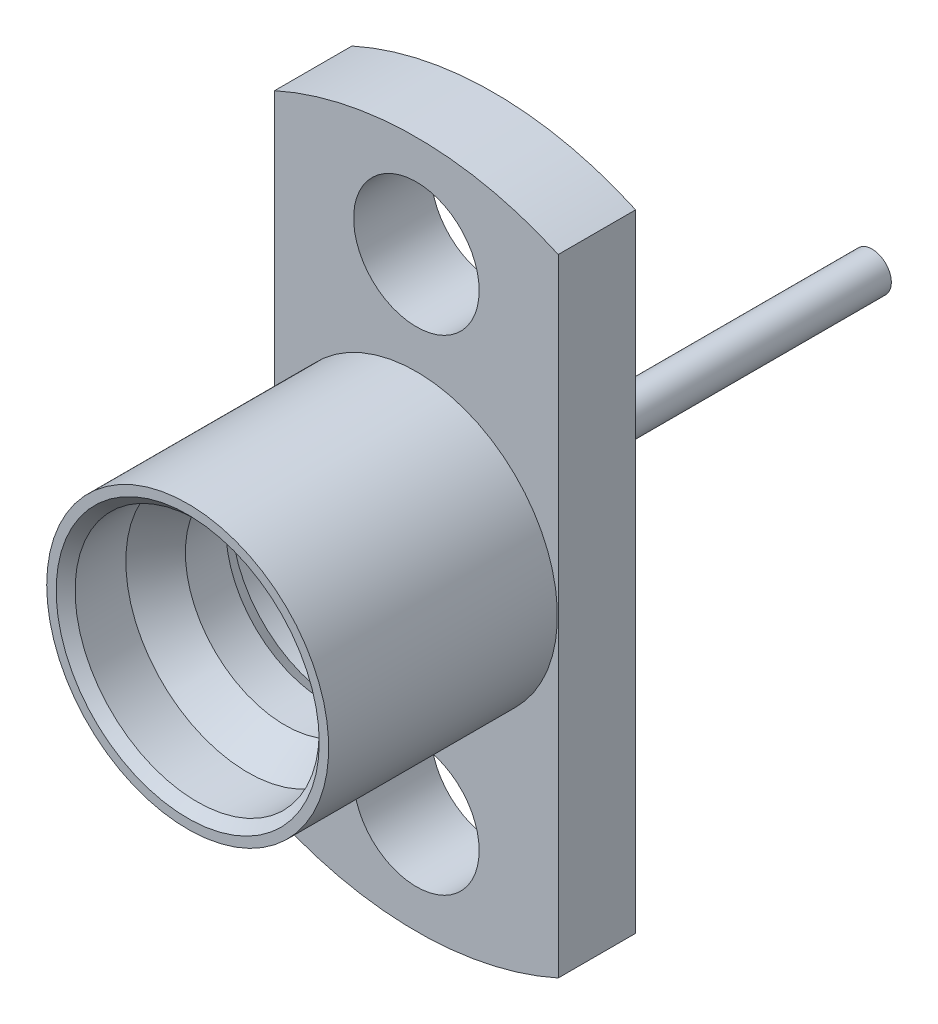
ISO-10303-21;
HEADER;
FILE_DESCRIPTION(('STEP AP214'),'2;1');
FILE_NAME('part.step','',(''),(''),'','','');
FILE_SCHEMA(('AUTOMOTIVE_DESIGN { 1 0 10303 214 1 1 1 1 }'));
ENDSEC;
DATA;
#1=APPLICATION_CONTEXT('core data for automotive mechanical design processes');
#2=APPLICATION_PROTOCOL_DEFINITION('international standard','automotive_design',2000,#1);
#3=PRODUCT_CONTEXT('',#1,'mechanical');
#4=PRODUCT('Part','Part','',(#3));
#5=PRODUCT_RELATED_PRODUCT_CATEGORY('part','',(#4));
#6=PRODUCT_DEFINITION_FORMATION('','',#4);
#7=PRODUCT_DEFINITION_CONTEXT('part definition',#1,'design');
#8=PRODUCT_DEFINITION('design','',#6,#7);
#9=PRODUCT_DEFINITION_SHAPE('','',#8);
#10=(LENGTH_UNIT() NAMED_UNIT(*) SI_UNIT(.MILLI.,.METRE.));
#11=(NAMED_UNIT(*) PLANE_ANGLE_UNIT() SI_UNIT($,.RADIAN.));
#12=(NAMED_UNIT(*) SI_UNIT($,.STERADIAN.) SOLID_ANGLE_UNIT());
#13=UNCERTAINTY_MEASURE_WITH_UNIT(LENGTH_MEASURE(1.E-05),#10,'distance_accuracy_value','');
#14=(GEOMETRIC_REPRESENTATION_CONTEXT(3) GLOBAL_UNCERTAINTY_ASSIGNED_CONTEXT((#13)) GLOBAL_UNIT_ASSIGNED_CONTEXT((#10,
#11,#12)) REPRESENTATION_CONTEXT('',''));
#15=CARTESIAN_POINT('',(0.,0.,0.));
#16=DIRECTION('',(0.,0.,1.));
#17=DIRECTION('',(1.,0.,0.));
#18=AXIS2_PLACEMENT_3D('',#15,#16,#17);
#19=CARTESIAN_POINT('',(0.,0.,-6.731));
#20=DIRECTION('',(0.,0.,-1.));
#21=DIRECTION('',(0.,-1.,0.));
#22=AXIS2_PLACEMENT_3D('',#19,#20,#21);
#23=PLANE('',#22);
#24=CARTESIAN_POINT('',(0.,0.,-6.731));
#25=DIRECTION('',(0.,0.,-1.));
#26=DIRECTION('',(-1.,0.,0.));
#27=AXIS2_PLACEMENT_3D('',#24,#25,#26);
#28=CIRCLE('',#27,0.28448);
#29=CARTESIAN_POINT('',(-0.28448,0.,-6.731));
#30=VERTEX_POINT('',#29);
#31=EDGE_CURVE('E11',#30,#30,#28,.T.);
#32=ORIENTED_EDGE('',*,*,#31,.T.);
#33=EDGE_LOOP('',(#32));
#34=FACE_BOUND('',#33,.T.);
#35=ADVANCED_FACE('F17',(#34),#23,.T.);
#36=CARTESIAN_POINT('',(0.,0.,-6.731));
#37=DIRECTION('',(0.,0.,1.));
#38=DIRECTION('',(1.,0.,0.));
#39=AXIS2_PLACEMENT_3D('',#36,#37,#38);
#40=CYLINDRICAL_SURFACE('',#39,0.28448);
#41=ORIENTED_EDGE('',*,*,#31,.F.);
#42=EDGE_LOOP('',(#41));
#43=FACE_BOUND('',#42,.T.);
#44=CARTESIAN_POINT('',(0.,0.,-1.143));
#45=DIRECTION('',(0.,0.,-1.));
#46=DIRECTION('',(-1.,0.,0.));
#47=AXIS2_PLACEMENT_3D('',#44,#45,#46);
#48=CIRCLE('',#47,0.28448);
#49=CARTESIAN_POINT('',(-0.28448,0.,-1.143));
#50=VERTEX_POINT('',#49);
#51=EDGE_CURVE('E26',#50,#50,#48,.T.);
#52=ORIENTED_EDGE('',*,*,#51,.T.);
#53=EDGE_LOOP('',(#52));
#54=FACE_BOUND('',#53,.T.);
#55=ADVANCED_FACE('F296',(#43,#54),#40,.T.);
#56=CARTESIAN_POINT('',(0.,0.,-1.143));
#57=DIRECTION('',(0.,0.,-1.));
#58=DIRECTION('',(0.,-1.,0.));
#59=AXIS2_PLACEMENT_3D('',#56,#57,#58);
#60=PLANE('',#59);
#61=ORIENTED_EDGE('',*,*,#51,.F.);
#62=EDGE_LOOP('',(#61));
#63=FACE_BOUND('',#62,.T.);
#64=CARTESIAN_POINT('',(0.,0.,-1.143));
#65=DIRECTION('',(0.,0.,-1.));
#66=DIRECTION('',(-1.,0.,0.));
#67=AXIS2_PLACEMENT_3D('',#64,#65,#66);
#68=CIRCLE('',#67,0.8509);
#69=CARTESIAN_POINT('',(-0.8509,0.,-1.143));
#70=VERTEX_POINT('',#69);
#71=EDGE_CURVE('E239',#70,#70,#68,.T.);
#72=ORIENTED_EDGE('',*,*,#71,.T.);
#73=EDGE_LOOP('',(#72));
#74=FACE_BOUND('',#73,.T.);
#75=ADVANCED_FACE('F300',(#63,#74),#60,.T.);
#76=CARTESIAN_POINT('',(0.,0.,-1.143));
#77=DIRECTION('',(0.,0.,-1.));
#78=DIRECTION('',(-1.,0.,0.));
#79=AXIS2_PLACEMENT_3D('',#76,#77,#78);
#80=CYLINDRICAL_SURFACE('',#79,0.8509);
#81=ORIENTED_EDGE('',*,*,#71,.F.);
#82=EDGE_LOOP('',(#81));
#83=FACE_BOUND('',#82,.T.);
#84=CARTESIAN_POINT('',(0.,0.,-1.2446));
#85=DIRECTION('',(0.,0.,-1.));
#86=DIRECTION('',(-1.,0.,0.));
#87=AXIS2_PLACEMENT_3D('',#84,#85,#86);
#88=CIRCLE('',#87,0.8509);
#89=CARTESIAN_POINT('',(-0.8509,0.,-1.2446));
#90=VERTEX_POINT('',#89);
#91=EDGE_CURVE('E236',#90,#90,#88,.T.);
#92=ORIENTED_EDGE('',*,*,#91,.T.);
#93=EDGE_LOOP('',(#92));
#94=FACE_BOUND('',#93,.T.);
#95=ADVANCED_FACE('F305',(#83,#94),#80,.F.);
#96=CARTESIAN_POINT('',(0.,0.,-1.2446));
#97=DIRECTION('',(0.,0.,-1.));
#98=DIRECTION('',(0.,-1.,0.));
#99=AXIS2_PLACEMENT_3D('',#96,#97,#98);
#100=PLANE('',#99);
#101=ORIENTED_EDGE('',*,*,#91,.F.);
#102=EDGE_LOOP('',(#101));
#103=FACE_BOUND('',#102,.T.);
#104=CARTESIAN_POINT('',(0.,0.,-1.2446));
#105=DIRECTION('',(0.,0.,-1.));
#106=DIRECTION('',(-1.,0.,0.));
#107=AXIS2_PLACEMENT_3D('',#104,#105,#106);
#108=CIRCLE('',#107,1.2319);
#109=CARTESIAN_POINT('',(-1.2319,0.,-1.2446));
#110=VERTEX_POINT('',#109);
#111=EDGE_CURVE('E233',#110,#110,#108,.T.);
#112=ORIENTED_EDGE('',*,*,#111,.T.);
#113=EDGE_LOOP('',(#112));
#114=FACE_BOUND('',#113,.T.);
#115=ADVANCED_FACE('F311',(#103,#114),#100,.T.);
#116=CARTESIAN_POINT('',(0.,0.,-1.2446));
#117=DIRECTION('',(0.,0.,1.));
#118=DIRECTION('',(1.,0.,0.));
#119=AXIS2_PLACEMENT_3D('',#116,#117,#118);
#120=CYLINDRICAL_SURFACE('',#119,1.2319);
#121=ORIENTED_EDGE('',*,*,#111,.F.);
#122=EDGE_LOOP('',(#121));
#123=FACE_BOUND('',#122,.T.);
#124=CARTESIAN_POINT('',(0.,0.,-1.143));
#125=DIRECTION('',(0.,0.,-1.));
#126=DIRECTION('',(-1.,0.,0.));
#127=AXIS2_PLACEMENT_3D('',#124,#125,#126);
#128=CIRCLE('',#127,1.2319);
#129=CARTESIAN_POINT('',(-1.2319,0.,-1.143));
#130=VERTEX_POINT('',#129);
#131=EDGE_CURVE('E214',#130,#130,#128,.T.);
#132=ORIENTED_EDGE('',*,*,#131,.T.);
#133=EDGE_LOOP('',(#132));
#134=FACE_BOUND('',#133,.T.);
#135=ADVANCED_FACE('F315',(#123,#134),#120,.T.);
#136=CARTESIAN_POINT('',(0.,0.,-5.715));
#137=DIRECTION('',(0.,0.,1.));
#138=DIRECTION('',(1.,0.,0.));
#139=AXIS2_PLACEMENT_3D('',#136,#137,#138);
#140=CYLINDRICAL_SURFACE('',#139,5.08);
#141=CARTESIAN_POINT('',(0.,0.,-1.143));
#142=DIRECTION('',(0.,0.,-1.));
#143=DIRECTION('',(-1.,0.,0.));
#144=AXIS2_PLACEMENT_3D('',#141,#142,#143);
#145=CIRCLE('',#144,5.08);
#146=CARTESIAN_POINT('',(-2.0955,4.62766461079452,-1.143));
#147=VERTEX_POINT('',#146);
#148=CARTESIAN_POINT('',(2.0955,4.62766461079452,-1.143));
#149=VERTEX_POINT('',#148);
#150=EDGE_CURVE('E210',#147,#149,#145,.T.);
#151=ORIENTED_EDGE('',*,*,#150,.F.);
#152=DIRECTION('',(0.,0.,-1.));
#153=VECTOR('',#152,1.);
#154=CARTESIAN_POINT('',(-2.0955,4.62766461079452,-5.715));
#155=LINE('',#154,#153);
#156=CARTESIAN_POINT('',(-2.0955,4.62766461079452,0.));
#157=VERTEX_POINT('',#156);
#158=EDGE_CURVE('E206',#157,#147,#155,.T.);
#159=ORIENTED_EDGE('',*,*,#158,.F.);
#160=CARTESIAN_POINT('',(0.,0.,0.));
#161=DIRECTION('',(0.,0.,-1.));
#162=DIRECTION('',(-1.,0.,0.));
#163=AXIS2_PLACEMENT_3D('',#160,#161,#162);
#164=CIRCLE('',#163,5.08);
#165=CARTESIAN_POINT('',(2.0955,4.62766461079452,0.));
#166=VERTEX_POINT('',#165);
#167=EDGE_CURVE('E221',#157,#166,#164,.T.);
#168=ORIENTED_EDGE('',*,*,#167,.T.);
#169=DIRECTION('',(0.,0.,1.));
#170=VECTOR('',#169,1.);
#171=CARTESIAN_POINT('',(2.0955,4.62766461079452,-5.715));
#172=LINE('',#171,#170);
#173=EDGE_CURVE('E176',#149,#166,#172,.T.);
#174=ORIENTED_EDGE('',*,*,#173,.F.);
#175=EDGE_LOOP('',(#151,#159,#168,#174));
#176=FACE_BOUND('',#175,.T.);
#177=ADVANCED_FACE('F319',(#176),#140,.T.);
#178=CARTESIAN_POINT('',(0.,0.,-5.715));
#179=DIRECTION('',(0.,0.,1.));
#180=DIRECTION('',(1.,0.,0.));
#181=AXIS2_PLACEMENT_3D('',#178,#179,#180);
#182=CYLINDRICAL_SURFACE('',#181,5.08);
#183=CARTESIAN_POINT('',(0.,0.,-1.143));
#184=DIRECTION('',(0.,0.,-1.));
#185=DIRECTION('',(-1.,0.,0.));
#186=AXIS2_PLACEMENT_3D('',#183,#184,#185);
#187=CIRCLE('',#186,5.08);
#188=CARTESIAN_POINT('',(2.0955,-4.62766461079452,-1.143));
#189=VERTEX_POINT('',#188);
#190=CARTESIAN_POINT('',(-2.0955,-4.62766461079452,-1.143));
#191=VERTEX_POINT('',#190);
#192=EDGE_CURVE('E211',#189,#191,#187,.T.);
#193=ORIENTED_EDGE('',*,*,#192,.F.);
#194=DIRECTION('',(0.,0.,-1.));
#195=VECTOR('',#194,1.);
#196=CARTESIAN_POINT('',(2.0955,-4.62766461079452,-5.715));
#197=LINE('',#196,#195);
#198=CARTESIAN_POINT('',(2.0955,-4.62766461079452,0.));
#199=VERTEX_POINT('',#198);
#200=EDGE_CURVE('E190',#199,#189,#197,.T.);
#201=ORIENTED_EDGE('',*,*,#200,.F.);
#202=CARTESIAN_POINT('',(0.,0.,0.));
#203=DIRECTION('',(0.,0.,-1.));
#204=DIRECTION('',(-1.,0.,0.));
#205=AXIS2_PLACEMENT_3D('',#202,#203,#204);
#206=CIRCLE('',#205,5.08);
#207=CARTESIAN_POINT('',(-2.0955,-4.62766461079452,0.));
#208=VERTEX_POINT('',#207);
#209=EDGE_CURVE('E224',#199,#208,#206,.T.);
#210=ORIENTED_EDGE('',*,*,#209,.T.);
#211=DIRECTION('',(0.,0.,1.));
#212=VECTOR('',#211,1.);
#213=CARTESIAN_POINT('',(-2.0955,-4.62766461079452,-5.715));
#214=LINE('',#213,#212);
#215=EDGE_CURVE('E198',#191,#208,#214,.T.);
#216=ORIENTED_EDGE('',*,*,#215,.F.);
#217=EDGE_LOOP('',(#193,#201,#210,#216));
#218=FACE_BOUND('',#217,.T.);
#219=ADVANCED_FACE('F323',(#218),#182,.T.);
#220=CARTESIAN_POINT('',(0.,-3.5814,-1.143));
#221=DIRECTION('',(0.,0.,1.));
#222=DIRECTION('',(1.,0.,0.));
#223=AXIS2_PLACEMENT_3D('',#220,#221,#222);
#224=CYLINDRICAL_SURFACE('',#223,0.9271);
#225=CARTESIAN_POINT('',(0.,-3.5814,-1.143));
#226=DIRECTION('',(0.,0.,1.));
#227=DIRECTION('',(1.,0.,0.));
#228=AXIS2_PLACEMENT_3D('',#225,#226,#227);
#229=CIRCLE('',#228,0.9271);
#230=CARTESIAN_POINT('',(0.9271,-3.5814,-1.143));
#231=VERTEX_POINT('',#230);
#232=EDGE_CURVE('E215',#231,#231,#229,.T.);
#233=ORIENTED_EDGE('',*,*,#232,.F.);
#234=EDGE_LOOP('',(#233));
#235=FACE_BOUND('',#234,.T.);
#236=CARTESIAN_POINT('',(0.,-3.5814,0.));
#237=DIRECTION('',(0.,0.,1.));
#238=DIRECTION('',(1.,0.,0.));
#239=AXIS2_PLACEMENT_3D('',#236,#237,#238);
#240=CIRCLE('',#239,0.9271);
#241=CARTESIAN_POINT('',(0.9271,-3.5814,0.));
#242=VERTEX_POINT('',#241);
#243=EDGE_CURVE('E227',#242,#242,#240,.T.);
#244=ORIENTED_EDGE('',*,*,#243,.T.);
#245=EDGE_LOOP('',(#244));
#246=FACE_BOUND('',#245,.T.);
#247=ADVANCED_FACE('F327',(#235,#246),#224,.F.);
#248=CARTESIAN_POINT('',(0.,3.5814,-1.143));
#249=DIRECTION('',(0.,0.,1.));
#250=DIRECTION('',(1.,0.,0.));
#251=AXIS2_PLACEMENT_3D('',#248,#249,#250);
#252=CYLINDRICAL_SURFACE('',#251,0.9271);
#253=CARTESIAN_POINT('',(0.,3.5814,-1.143));
#254=DIRECTION('',(0.,0.,1.));
#255=DIRECTION('',(1.,0.,0.));
#256=AXIS2_PLACEMENT_3D('',#253,#254,#255);
#257=CIRCLE('',#256,0.9271);
#258=CARTESIAN_POINT('',(0.9271,3.5814,-1.143));
#259=VERTEX_POINT('',#258);
#260=EDGE_CURVE('E218',#259,#259,#257,.T.);
#261=ORIENTED_EDGE('',*,*,#260,.F.);
#262=EDGE_LOOP('',(#261));
#263=FACE_BOUND('',#262,.T.);
#264=CARTESIAN_POINT('',(0.,3.5814,0.));
#265=DIRECTION('',(0.,0.,1.));
#266=DIRECTION('',(1.,0.,0.));
#267=AXIS2_PLACEMENT_3D('',#264,#265,#266);
#268=CIRCLE('',#267,0.9271);
#269=CARTESIAN_POINT('',(0.9271,3.5814,0.));
#270=VERTEX_POINT('',#269);
#271=EDGE_CURVE('E230',#270,#270,#268,.T.);
#272=ORIENTED_EDGE('',*,*,#271,.T.);
#273=EDGE_LOOP('',(#272));
#274=FACE_BOUND('',#273,.T.);
#275=ADVANCED_FACE('F331',(#263,#274),#252,.F.);
#276=CARTESIAN_POINT('',(0.,0.,0.));
#277=DIRECTION('',(0.,0.,-1.));
#278=DIRECTION('',(0.,-1.,0.));
#279=AXIS2_PLACEMENT_3D('',#276,#277,#278);
#280=PLANE('',#279);
#281=ORIENTED_EDGE('',*,*,#271,.F.);
#282=EDGE_LOOP('',(#281));
#283=FACE_BOUND('',#282,.T.);
#284=ORIENTED_EDGE('',*,*,#243,.F.);
#285=EDGE_LOOP('',(#284));
#286=FACE_BOUND('',#285,.T.);
#287=CARTESIAN_POINT('',(0.,0.,0.));
#288=DIRECTION('',(0.,0.,-1.));
#289=DIRECTION('',(-1.,0.,0.));
#290=AXIS2_PLACEMENT_3D('',#287,#288,#289);
#291=CIRCLE('',#290,2.0828);
#292=CARTESIAN_POINT('',(-2.0828,0.,0.));
#293=VERTEX_POINT('',#292);
#294=EDGE_CURVE('E266',#293,#293,#291,.T.);
#295=ORIENTED_EDGE('',*,*,#294,.T.);
#296=EDGE_LOOP('',(#295));
#297=FACE_BOUND('',#296,.T.);
#298=ORIENTED_EDGE('',*,*,#167,.F.);
#299=DIRECTION('',(0.,-1.,0.));
#300=VECTOR('',#299,1.);
#301=CARTESIAN_POINT('',(-2.0955,-5.08,0.));
#302=LINE('',#301,#300);
#303=EDGE_CURVE('E202',#157,#208,#302,.T.);
#304=ORIENTED_EDGE('',*,*,#303,.T.);
#305=ORIENTED_EDGE('',*,*,#209,.F.);
#306=DIRECTION('',(0.,1.,0.));
#307=VECTOR('',#306,1.);
#308=CARTESIAN_POINT('',(2.0955,-5.08,0.));
#309=LINE('',#308,#307);
#310=EDGE_CURVE('E189',#199,#166,#309,.T.);
#311=ORIENTED_EDGE('',*,*,#310,.T.);
#312=EDGE_LOOP('',(#298,#304,#305,#311));
#313=FACE_BOUND('',#312,.T.);
#314=ADVANCED_FACE('F279',(#283,#286,#297,#313),#280,.F.);
#315=CARTESIAN_POINT('',(0.,0.,-1.143));
#316=DIRECTION('',(0.,0.,-1.));
#317=DIRECTION('',(0.,-1.,0.));
#318=AXIS2_PLACEMENT_3D('',#315,#316,#317);
#319=PLANE('',#318);
#320=ORIENTED_EDGE('',*,*,#260,.T.);
#321=EDGE_LOOP('',(#320));
#322=FACE_BOUND('',#321,.T.);
#323=ORIENTED_EDGE('',*,*,#232,.T.);
#324=EDGE_LOOP('',(#323));
#325=FACE_BOUND('',#324,.T.);
#326=ORIENTED_EDGE('',*,*,#131,.F.);
#327=EDGE_LOOP('',(#326));
#328=FACE_BOUND('',#327,.T.);
#329=DIRECTION('',(0.,-1.,0.));
#330=VECTOR('',#329,1.);
#331=CARTESIAN_POINT('',(-2.0955,-5.08,-1.143));
#332=LINE('',#331,#330);
#333=EDGE_CURVE('E194',#147,#191,#332,.T.);
#334=ORIENTED_EDGE('',*,*,#333,.F.);
#335=ORIENTED_EDGE('',*,*,#150,.T.);
#336=DIRECTION('',(0.,1.,0.));
#337=VECTOR('',#336,1.);
#338=CARTESIAN_POINT('',(2.0955,-5.08,-1.143));
#339=LINE('',#338,#337);
#340=EDGE_CURVE('E168',#189,#149,#339,.T.);
#341=ORIENTED_EDGE('',*,*,#340,.F.);
#342=ORIENTED_EDGE('',*,*,#192,.T.);
#343=EDGE_LOOP('',(#334,#335,#341,#342));
#344=FACE_BOUND('',#343,.T.);
#345=ADVANCED_FACE('F338',(#322,#325,#328,#344),#319,.T.);
#346=CARTESIAN_POINT('',(-2.0955,-5.08,-1.143));
#347=DIRECTION('',(-1.,0.,0.));
#348=DIRECTION('',(0.,0.,1.));
#349=AXIS2_PLACEMENT_3D('',#346,#347,#348);
#350=PLANE('',#349);
#351=ORIENTED_EDGE('',*,*,#333,.T.);
#352=ORIENTED_EDGE('',*,*,#215,.T.);
#353=ORIENTED_EDGE('',*,*,#303,.F.);
#354=ORIENTED_EDGE('',*,*,#158,.T.);
#355=EDGE_LOOP('',(#351,#352,#353,#354));
#356=FACE_BOUND('',#355,.T.);
#357=ADVANCED_FACE('F344',(#356),#350,.T.);
#358=CARTESIAN_POINT('',(2.0955,-5.08,-1.143));
#359=DIRECTION('',(1.,0.,0.));
#360=DIRECTION('',(0.,1.,0.));
#361=AXIS2_PLACEMENT_3D('',#358,#359,#360);
#362=PLANE('',#361);
#363=ORIENTED_EDGE('',*,*,#340,.T.);
#364=ORIENTED_EDGE('',*,*,#173,.T.);
#365=ORIENTED_EDGE('',*,*,#310,.F.);
#366=ORIENTED_EDGE('',*,*,#200,.T.);
#367=EDGE_LOOP('',(#363,#364,#365,#366));
#368=FACE_BOUND('',#367,.T.);
#369=ADVANCED_FACE('F340',(#368),#362,.T.);
#370=CARTESIAN_POINT('',(0.,0.,1.6637));
#371=DIRECTION('',(0.,1.,0.));
#372=DIRECTION('',(-1.,0.,0.));
#373=AXIS2_PLACEMENT_3D('',#370,#371,#372);
#374=SPHERICAL_SURFACE('',#373,0.1905);
#375=CARTESIAN_POINT('',(0.,0.,1.6637));
#376=DIRECTION('',(0.,0.,-1.));
#377=DIRECTION('',(1.,0.,0.));
#378=AXIS2_PLACEMENT_3D('',#375,#376,#377);
#379=SPHERICAL_SURFACE('',#378,0.1905);
#380=CARTESIAN_POINT('',(0.,0.,1.6637));
#381=DIRECTION('',(0.,0.,-1.));
#382=DIRECTION('',(1.,0.,0.));
#383=AXIS2_PLACEMENT_3D('',#380,#381,#382);
#384=CIRCLE('',#383,0.1905);
#385=CARTESIAN_POINT('',(0.1905,0.,1.6637));
#386=VERTEX_POINT('',#385);
#387=EDGE_CURVE('E163',#386,#386,#384,.T.);
#388=ORIENTED_EDGE('',*,*,#387,.F.);
#389=EDGE_LOOP('',(#388));
#390=FACE_BOUND('',#389,.T.);
#391=ADVANCED_FACE('F343',(#390),#379,.T.);
#392=CARTESIAN_POINT('',(0.,0.,1.8542));
#393=DIRECTION('',(0.,0.,1.));
#394=DIRECTION('',(1.,0.,0.));
#395=AXIS2_PLACEMENT_3D('',#392,#393,#394);
#396=CYLINDRICAL_SURFACE('',#395,0.1905);
#397=ORIENTED_EDGE('',*,*,#387,.T.);
#398=EDGE_LOOP('',(#397));
#399=FACE_BOUND('',#398,.T.);
#400=CARTESIAN_POINT('',(0.,0.,0.00234417975382255));
#401=DIRECTION('',(0.,0.,-1.));
#402=DIRECTION('',(-1.,0.,0.));
#403=AXIS2_PLACEMENT_3D('',#400,#401,#402);
#404=CIRCLE('',#403,0.1905);
#405=CARTESIAN_POINT('',(0.1905,0.,0.00234417975382255));
#406=VERTEX_POINT('',#405);
#407=EDGE_CURVE('E169',#406,#406,#404,.F.);
#408=ORIENTED_EDGE('',*,*,#407,.T.);
#409=EDGE_LOOP('',(#408));
#410=FACE_BOUND('',#409,.T.);
#411=ADVANCED_FACE('F164',(#399,#410),#396,.T.);
#412=CARTESIAN_POINT('',(0.,0.1905,0.00234417975382255));
#413=DIRECTION('',(0.,0.,-1.));
#414=DIRECTION('',(0.,-1.,0.));
#415=AXIS2_PLACEMENT_3D('',#412,#413,#414);
#416=PLANE('',#415);
#417=ORIENTED_EDGE('',*,*,#407,.F.);
#418=EDGE_LOOP('',(#417));
#419=FACE_BOUND('',#418,.T.);
#420=CARTESIAN_POINT('',(0.,0.,0.00234417975382255));
#421=DIRECTION('',(0.,0.,-1.));
#422=DIRECTION('',(-1.,0.,0.));
#423=AXIS2_PLACEMENT_3D('',#420,#421,#422);
#424=CIRCLE('',#423,0.392762856947935);
#425=CARTESIAN_POINT('',(0.392762856947935,0.,0.00234417975382255));
#426=VERTEX_POINT('',#425);
#427=EDGE_CURVE('E20',#426,#426,#424,.F.);
#428=ORIENTED_EDGE('',*,*,#427,.T.);
#429=EDGE_LOOP('',(#428));
#430=FACE_BOUND('',#429,.T.);
#431=ADVANCED_FACE('F348',(#419,#430),#416,.F.);
#432=CARTESIAN_POINT('',(0.,0.,1.8542));
#433=DIRECTION('',(0.,0.,1.));
#434=DIRECTION('',(1.,0.,0.));
#435=AXIS2_PLACEMENT_3D('',#432,#433,#434);
#436=CYLINDRICAL_SURFACE('',#435,0.392762856947935);
#437=ORIENTED_EDGE('',*,*,#427,.F.);
#438=EDGE_LOOP('',(#437));
#439=FACE_BOUND('',#438,.T.);
#440=CARTESIAN_POINT('',(0.,0.,0.5842));
#441=DIRECTION('',(0.,0.,1.));
#442=DIRECTION('',(1.,0.,0.));
#443=AXIS2_PLACEMENT_3D('',#440,#441,#442);
#444=CIRCLE('',#443,0.392762856947935);
#445=CARTESIAN_POINT('',(0.392762856947935,0.,0.5842));
#446=VERTEX_POINT('',#445);
#447=EDGE_CURVE('E184',#446,#446,#444,.T.);
#448=ORIENTED_EDGE('',*,*,#447,.T.);
#449=EDGE_LOOP('',(#448));
#450=FACE_BOUND('',#449,.T.);
#451=ADVANCED_FACE('F351',(#439,#450),#436,.F.);
#452=CARTESIAN_POINT('',(0.,0.392762856947935,0.5842));
#453=DIRECTION('',(0.,0.,-1.));
#454=DIRECTION('',(0.,-1.,0.));
#455=AXIS2_PLACEMENT_3D('',#452,#453,#454);
#456=PLANE('',#455);
#457=ORIENTED_EDGE('',*,*,#447,.F.);
#458=EDGE_LOOP('',(#457));
#459=FACE_BOUND('',#458,.T.);
#460=CARTESIAN_POINT('',(0.,0.,0.5842));
#461=DIRECTION('',(0.,0.,1.));
#462=DIRECTION('',(1.,0.,0.));
#463=AXIS2_PLACEMENT_3D('',#460,#461,#462);
#464=CIRCLE('',#463,1.5875);
#465=CARTESIAN_POINT('',(1.5875,0.,0.5842));
#466=VERTEX_POINT('',#465);
#467=EDGE_CURVE('E182',#466,#466,#464,.T.);
#468=ORIENTED_EDGE('',*,*,#467,.T.);
#469=EDGE_LOOP('',(#468));
#470=FACE_BOUND('',#469,.T.);
#471=ADVANCED_FACE('F357',(#459,#470),#456,.F.);
#472=CARTESIAN_POINT('',(0.,0.,1.8542));
#473=DIRECTION('',(0.,0.,1.));
#474=DIRECTION('',(1.,0.,0.));
#475=AXIS2_PLACEMENT_3D('',#472,#473,#474);
#476=CYLINDRICAL_SURFACE('',#475,1.5875);
#477=ORIENTED_EDGE('',*,*,#467,.F.);
#478=EDGE_LOOP('',(#477));
#479=FACE_BOUND('',#478,.T.);
#480=CARTESIAN_POINT('',(0.,0.,1.143));
#481=DIRECTION('',(0.,0.,1.));
#482=DIRECTION('',(1.,0.,0.));
#483=AXIS2_PLACEMENT_3D('',#480,#481,#482);
#484=CIRCLE('',#483,1.5875);
#485=CARTESIAN_POINT('',(1.5875,0.,1.143));
#486=VERTEX_POINT('',#485);
#487=EDGE_CURVE('E180',#486,#486,#484,.T.);
#488=ORIENTED_EDGE('',*,*,#487,.T.);
#489=EDGE_LOOP('',(#488));
#490=FACE_BOUND('',#489,.T.);
#491=ADVANCED_FACE('F361',(#479,#490),#476,.F.);
#492=CARTESIAN_POINT('',(0.,0.,1.34097340730512));
#493=DIRECTION('',(0.,0.,-1.));
#494=DIRECTION('',(-1.,0.,0.));
#495=AXIS2_PLACEMENT_3D('',#492,#493,#494);
#496=CONICAL_SURFACE('',#495,1.4732,0.523598775598299);
#497=CARTESIAN_POINT('',(0.,0.,1.34097340730512));
#498=DIRECTION('',(0.,0.,1.));
#499=DIRECTION('',(1.,0.,0.));
#500=AXIS2_PLACEMENT_3D('',#497,#498,#499);
#501=CIRCLE('',#500,1.4732);
#502=CARTESIAN_POINT('',(1.4732,0.,1.34097340730512));
#503=VERTEX_POINT('',#502);
#504=EDGE_CURVE('E252',#503,#503,#501,.T.);
#505=ORIENTED_EDGE('',*,*,#504,.T.);
#506=EDGE_LOOP('',(#505));
#507=FACE_BOUND('',#506,.T.);
#508=ORIENTED_EDGE('',*,*,#487,.F.);
#509=EDGE_LOOP('',(#508));
#510=FACE_BOUND('',#509,.T.);
#511=ADVANCED_FACE('F368',(#507,#510),#496,.F.);
#512=CARTESIAN_POINT('',(0.,0.,1.8542));
#513=DIRECTION('',(0.,0.,1.));
#514=DIRECTION('',(1.,0.,0.));
#515=AXIS2_PLACEMENT_3D('',#512,#513,#514);
#516=CYLINDRICAL_SURFACE('',#515,1.4732);
#517=ORIENTED_EDGE('',*,*,#504,.F.);
#518=EDGE_LOOP('',(#517));
#519=FACE_BOUND('',#518,.T.);
#520=CARTESIAN_POINT('',(0.,0.,1.93965491492786));
#521=DIRECTION('',(0.,0.,1.));
#522=DIRECTION('',(1.,0.,0.));
#523=AXIS2_PLACEMENT_3D('',#520,#521,#522);
#524=CIRCLE('',#523,1.4732);
#525=CARTESIAN_POINT('',(1.4732,0.,1.93965491492786));
#526=VERTEX_POINT('',#525);
#527=EDGE_CURVE('E249',#526,#526,#524,.T.);
#528=ORIENTED_EDGE('',*,*,#527,.T.);
#529=EDGE_LOOP('',(#528));
#530=FACE_BOUND('',#529,.T.);
#531=ADVANCED_FACE('F372',(#519,#530),#516,.F.);
#532=CARTESIAN_POINT('',(0.,0.,2.4892));
#533=DIRECTION('',(0.,0.,1.));
#534=DIRECTION('',(1.,0.,0.));
#535=AXIS2_PLACEMENT_3D('',#532,#533,#534);
#536=CONICAL_SURFACE('',#535,1.8034,0.541052068118243);
#537=ORIENTED_EDGE('',*,*,#527,.F.);
#538=EDGE_LOOP('',(#537));
#539=FACE_BOUND('',#538,.T.);
#540=CARTESIAN_POINT('',(0.,0.,2.4892));
#541=DIRECTION('',(0.,0.,1.));
#542=DIRECTION('',(1.,0.,0.));
#543=AXIS2_PLACEMENT_3D('',#540,#541,#542);
#544=CIRCLE('',#543,1.8034);
#545=CARTESIAN_POINT('',(1.8034,0.,2.4892));
#546=VERTEX_POINT('',#545);
#547=EDGE_CURVE('E253',#546,#546,#544,.T.);
#548=ORIENTED_EDGE('',*,*,#547,.T.);
#549=EDGE_LOOP('',(#548));
#550=FACE_BOUND('',#549,.T.);
#551=ADVANCED_FACE('F376',(#539,#550),#536,.F.);
#552=CARTESIAN_POINT('',(0.,0.,1.8542));
#553=DIRECTION('',(0.,0.,1.));
#554=DIRECTION('',(1.,0.,0.));
#555=AXIS2_PLACEMENT_3D('',#552,#553,#554);
#556=CYLINDRICAL_SURFACE('',#555,1.8034);
#557=ORIENTED_EDGE('',*,*,#547,.F.);
#558=EDGE_LOOP('',(#557));
#559=FACE_BOUND('',#558,.T.);
#560=CARTESIAN_POINT('',(0.,0.,3.2385));
#561=DIRECTION('',(0.,0.,1.));
#562=DIRECTION('',(1.,0.,0.));
#563=AXIS2_PLACEMENT_3D('',#560,#561,#562);
#564=CIRCLE('',#563,1.8034);
#565=CARTESIAN_POINT('',(1.8034,0.,3.2385));
#566=VERTEX_POINT('',#565);
#567=EDGE_CURVE('E254',#566,#566,#564,.T.);
#568=ORIENTED_EDGE('',*,*,#567,.T.);
#569=EDGE_LOOP('',(#568));
#570=FACE_BOUND('',#569,.T.);
#571=ADVANCED_FACE('F380',(#559,#570),#556,.F.);
#572=CARTESIAN_POINT('',(0.,0.,3.3782));
#573=DIRECTION('',(0.,0.,1.));
#574=DIRECTION('',(1.,0.,0.));
#575=AXIS2_PLACEMENT_3D('',#572,#573,#574);
#576=CONICAL_SURFACE('',#575,1.9431,0.78539816339745);
#577=ORIENTED_EDGE('',*,*,#567,.F.);
#578=EDGE_LOOP('',(#577));
#579=FACE_BOUND('',#578,.T.);
#580=CARTESIAN_POINT('',(0.,0.,3.3782));
#581=DIRECTION('',(0.,0.,1.));
#582=DIRECTION('',(1.,0.,0.));
#583=AXIS2_PLACEMENT_3D('',#580,#581,#582);
#584=CIRCLE('',#583,1.9431);
#585=CARTESIAN_POINT('',(1.9431,0.,3.3782));
#586=VERTEX_POINT('',#585);
#587=EDGE_CURVE('E257',#586,#586,#584,.T.);
#588=ORIENTED_EDGE('',*,*,#587,.T.);
#589=EDGE_LOOP('',(#588));
#590=FACE_BOUND('',#589,.T.);
#591=ADVANCED_FACE('F291',(#579,#590),#576,.F.);
#592=CARTESIAN_POINT('',(0.,1.9431,3.3782));
#593=DIRECTION('',(0.,0.,-1.));
#594=DIRECTION('',(0.,-1.,0.));
#595=AXIS2_PLACEMENT_3D('',#592,#593,#594);
#596=PLANE('',#595);
#597=ORIENTED_EDGE('',*,*,#587,.F.);
#598=EDGE_LOOP('',(#597));
#599=FACE_BOUND('',#598,.T.);
#600=CARTESIAN_POINT('',(0.,0.,3.3782));
#601=DIRECTION('',(0.,0.,1.));
#602=DIRECTION('',(-1.,0.,0.));
#603=AXIS2_PLACEMENT_3D('',#600,#601,#602);
#604=CIRCLE('',#603,2.0828);
#605=CARTESIAN_POINT('',(-2.0828,0.,3.3782));
#606=VERTEX_POINT('',#605);
#607=EDGE_CURVE('E263',#606,#606,#604,.T.);
#608=ORIENTED_EDGE('',*,*,#607,.T.);
#609=EDGE_LOOP('',(#608));
#610=FACE_BOUND('',#609,.T.);
#611=ADVANCED_FACE('F284',(#599,#610),#596,.F.);
#612=CARTESIAN_POINT('',(0.,0.,6.096));
#613=DIRECTION('',(0.,0.,-1.));
#614=DIRECTION('',(-1.,0.,0.));
#615=AXIS2_PLACEMENT_3D('',#612,#613,#614);
#616=CYLINDRICAL_SURFACE('',#615,2.0828);
#617=ORIENTED_EDGE('',*,*,#607,.F.);
#618=EDGE_LOOP('',(#617));
#619=FACE_BOUND('',#618,.T.);
#620=ORIENTED_EDGE('',*,*,#294,.F.);
#621=EDGE_LOOP('',(#620));
#622=FACE_BOUND('',#621,.T.);
#623=ADVANCED_FACE('F282',(#619,#622),#616,.T.);
#624=CLOSED_SHELL('',(#35,#55,#75,#95,#115,#135,#177,#219,#247,#275,#314,#345,#357,#369,#391,
#411,#431,#451,#471,#491,#511,#531,#551,#571,#591,#611,#623));
#625=MANIFOLD_SOLID_BREP('B1',#624);
#626=ADVANCED_BREP_SHAPE_REPRESENTATION('',(#18,#625),#14);
#627=SHAPE_DEFINITION_REPRESENTATION(#9,#626);
ENDSEC;
END-ISO-10303-21;
